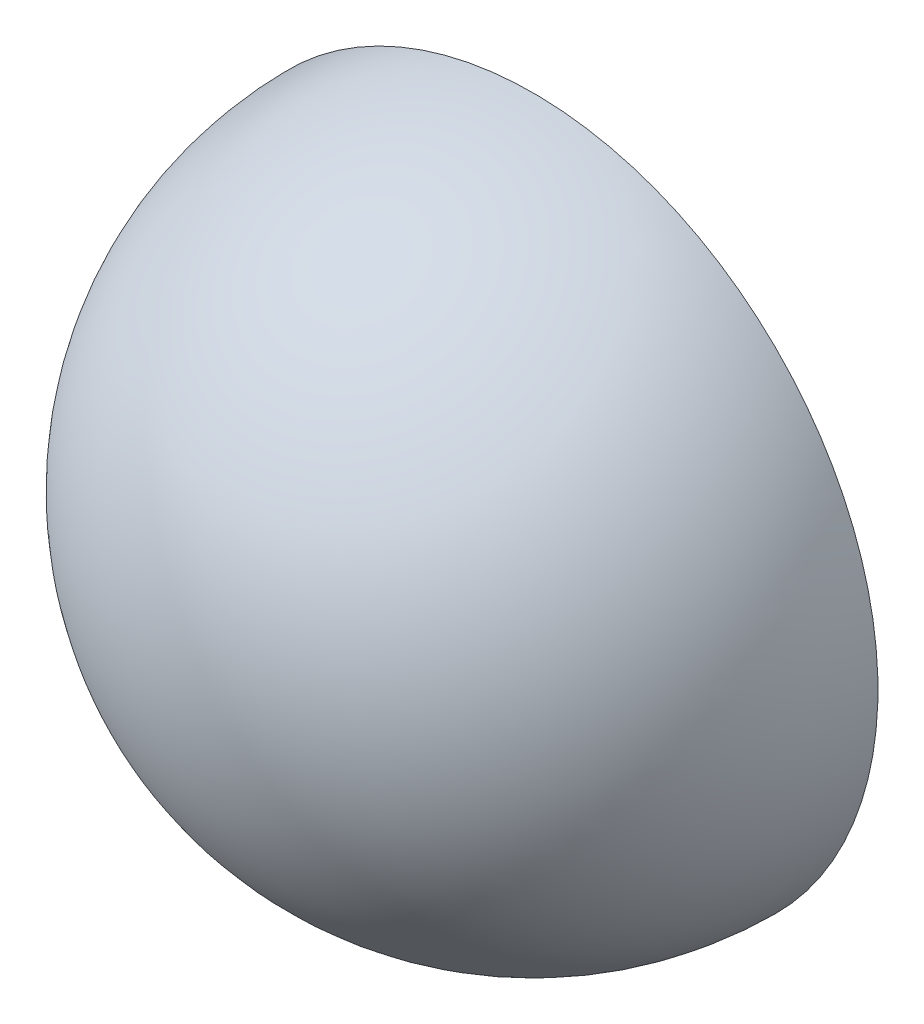
ISO-10303-21;
HEADER;
FILE_DESCRIPTION(('STEP AP214'),'2;1');
FILE_NAME('part.step','',(''),(''),'','','');
FILE_SCHEMA(('AUTOMOTIVE_DESIGN { 1 0 10303 214 1 1 1 1 }'));
ENDSEC;
DATA;
#1=APPLICATION_CONTEXT('core data for automotive mechanical design processes');
#2=APPLICATION_PROTOCOL_DEFINITION('international standard','automotive_design',2000,#1);
#3=PRODUCT_CONTEXT('',#1,'mechanical');
#4=PRODUCT('Part','Part','',(#3));
#5=PRODUCT_RELATED_PRODUCT_CATEGORY('part','',(#4));
#6=PRODUCT_DEFINITION_FORMATION('','',#4);
#7=PRODUCT_DEFINITION_CONTEXT('part definition',#1,'design');
#8=PRODUCT_DEFINITION('design','',#6,#7);
#9=PRODUCT_DEFINITION_SHAPE('','',#8);
#10=(LENGTH_UNIT() NAMED_UNIT(*) SI_UNIT(.MILLI.,.METRE.));
#11=(NAMED_UNIT(*) PLANE_ANGLE_UNIT() SI_UNIT($,.RADIAN.));
#12=(NAMED_UNIT(*) SI_UNIT($,.STERADIAN.) SOLID_ANGLE_UNIT());
#13=UNCERTAINTY_MEASURE_WITH_UNIT(LENGTH_MEASURE(1.E-05),#10,'distance_accuracy_value','');
#14=(GEOMETRIC_REPRESENTATION_CONTEXT(3) GLOBAL_UNCERTAINTY_ASSIGNED_CONTEXT((#13)) GLOBAL_UNIT_ASSIGNED_CONTEXT((#10,
#11,#12)) REPRESENTATION_CONTEXT('',''));
#15=CARTESIAN_POINT('',(0.,0.,0.));
#16=DIRECTION('',(0.,0.,1.));
#17=DIRECTION('',(1.,0.,0.));
#18=AXIS2_PLACEMENT_3D('',#15,#16,#17);
#19=CARTESIAN_POINT('',(-60.,0.,0.));
#20=DIRECTION('',(-1.,0.,0.));
#21=DIRECTION('',(0.,-1.,0.));
#22=AXIS2_PLACEMENT_3D('',#19,#20,#21);
#23=SPHERICAL_SURFACE('',#22,60.);
#24=CARTESIAN_POINT('',(-60.,0.,0.));
#25=DIRECTION('',(0.,0.,-1.));
#26=DIRECTION('',(-1.,0.,0.));
#27=AXIS2_PLACEMENT_3D('',#24,#25,#26);
#28=SPHERICAL_SURFACE('',#27,60.);
#29=CARTESIAN_POINT('',(-60.,0.,0.));
#30=DIRECTION('',(0.,0.,-1.));
#31=DIRECTION('',(-1.,0.,0.));
#32=AXIS2_PLACEMENT_3D('',#29,#30,#31);
#33=CIRCLE('',#32,60.);
#34=CARTESIAN_POINT('',(-120.,0.,0.));
#35=VERTEX_POINT('',#34);
#36=EDGE_CURVE('E47',#35,#35,#33,.T.);
#37=ORIENTED_EDGE('',*,*,#36,.F.);
#38=EDGE_LOOP('',(#37));
#39=FACE_BOUND('',#38,.T.);
#40=ADVANCED_FACE('F39',(#39),#28,.T.);
#41=CARTESIAN_POINT('',(-60.,0.,0.));
#42=DIRECTION('',(-1.,0.,0.));
#43=DIRECTION('',(0.,1.,0.));
#44=AXIS2_PLACEMENT_3D('',#41,#42,#43);
#45=SPHERICAL_SURFACE('',#44,59.);
#46=CARTESIAN_POINT('',(-60.,0.,0.));
#47=DIRECTION('',(0.,0.,1.));
#48=DIRECTION('',(-1.,0.,0.));
#49=AXIS2_PLACEMENT_3D('',#46,#47,#48);
#50=SPHERICAL_SURFACE('',#49,59.);
#51=CARTESIAN_POINT('',(-60.,0.,0.));
#52=DIRECTION('',(0.,0.,1.));
#53=DIRECTION('',(-1.,0.,0.));
#54=AXIS2_PLACEMENT_3D('',#51,#52,#53);
#55=CIRCLE('',#54,59.);
#56=CARTESIAN_POINT('',(-119.,0.,0.));
#57=VERTEX_POINT('',#56);
#58=EDGE_CURVE('E10',#57,#57,#55,.T.);
#59=ORIENTED_EDGE('',*,*,#58,.F.);
#60=EDGE_LOOP('',(#59));
#61=FACE_BOUND('',#60,.T.);
#62=ADVANCED_FACE('F41',(#61),#50,.F.);
#63=CARTESIAN_POINT('',(-60.,0.,0.));
#64=DIRECTION('',(0.,0.,1.));
#65=DIRECTION('',(-1.,0.,0.));
#66=AXIS2_PLACEMENT_3D('',#63,#64,#65);
#67=PLANE('',#66);
#68=ORIENTED_EDGE('',*,*,#58,.T.);
#69=EDGE_LOOP('',(#68));
#70=FACE_BOUND('',#69,.T.);
#71=ORIENTED_EDGE('',*,*,#36,.T.);
#72=EDGE_LOOP('',(#71));
#73=FACE_BOUND('',#72,.T.);
#74=ADVANCED_FACE('F54',(#70,#73),#67,.F.);
#75=CLOSED_SHELL('',(#40,#62,#74));
#76=MANIFOLD_SOLID_BREP('B2',#75);
#77=ADVANCED_BREP_SHAPE_REPRESENTATION('',(#18,#76),#14);
#78=SHAPE_DEFINITION_REPRESENTATION(#9,#77);
ENDSEC;
END-ISO-10303-21;
